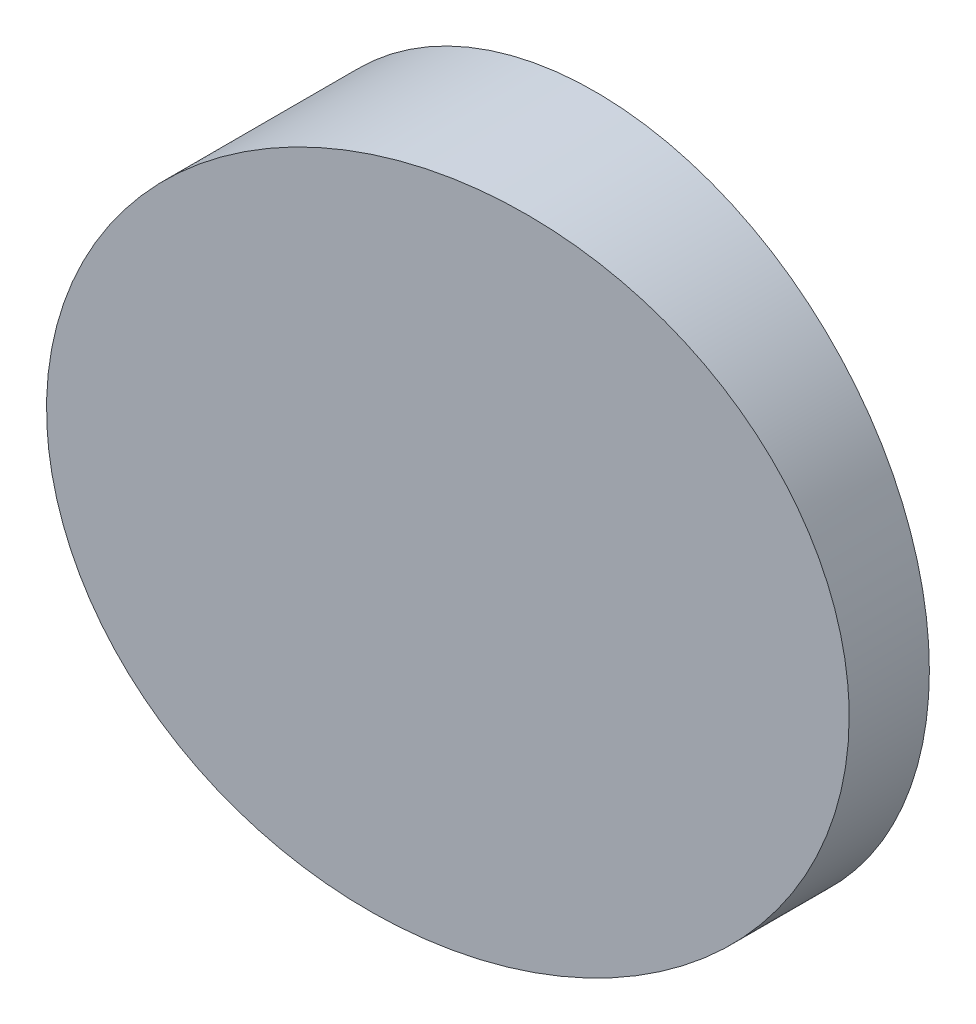
ISO-10303-21;
HEADER;
FILE_DESCRIPTION(('STEP AP214'),'2;1');
FILE_NAME('part.step','',(''),(''),'','','');
FILE_SCHEMA(('AUTOMOTIVE_DESIGN { 1 0 10303 214 1 1 1 1 }'));
ENDSEC;
DATA;
#1=APPLICATION_CONTEXT('core data for automotive mechanical design processes');
#2=APPLICATION_PROTOCOL_DEFINITION('international standard','automotive_design',2000,#1);
#3=PRODUCT_CONTEXT('',#1,'mechanical');
#4=PRODUCT('Part','Part','',(#3));
#5=PRODUCT_RELATED_PRODUCT_CATEGORY('part','',(#4));
#6=PRODUCT_DEFINITION_FORMATION('','',#4);
#7=PRODUCT_DEFINITION_CONTEXT('part definition',#1,'design');
#8=PRODUCT_DEFINITION('design','',#6,#7);
#9=PRODUCT_DEFINITION_SHAPE('','',#8);
#10=(LENGTH_UNIT() NAMED_UNIT(*) SI_UNIT(.MILLI.,.METRE.));
#11=(NAMED_UNIT(*) PLANE_ANGLE_UNIT() SI_UNIT($,.RADIAN.));
#12=(NAMED_UNIT(*) SI_UNIT($,.STERADIAN.) SOLID_ANGLE_UNIT());
#13=UNCERTAINTY_MEASURE_WITH_UNIT(LENGTH_MEASURE(1.E-05),#10,'distance_accuracy_value','');
#14=(GEOMETRIC_REPRESENTATION_CONTEXT(3) GLOBAL_UNCERTAINTY_ASSIGNED_CONTEXT((#13)) GLOBAL_UNIT_ASSIGNED_CONTEXT((#10,
#11,#12)) REPRESENTATION_CONTEXT('',''));
#15=CARTESIAN_POINT('',(0.,0.,0.));
#16=DIRECTION('',(0.,0.,1.));
#17=DIRECTION('',(1.,0.,0.));
#18=AXIS2_PLACEMENT_3D('',#15,#16,#17);
#19=CARTESIAN_POINT('',(0.,0.,10.));
#20=DIRECTION('',(0.,0.,-1.));
#21=DIRECTION('',(-1.,0.,0.));
#22=AXIS2_PLACEMENT_3D('',#19,#20,#21);
#23=CYLINDRICAL_SURFACE('',#22,12.5);
#24=CARTESIAN_POINT('',(0.,0.,5.50909230641996));
#25=DIRECTION('',(-0.196801817247395,0.,-0.980443289909275));
#26=DIRECTION('',(0.980443289909275,0.,-0.196801817247395));
#27=AXIS2_PLACEMENT_3D('',#24,#25,#26);
#28=ELLIPSE('',#27,12.7493350494108,12.5);
#29=CARTESIAN_POINT('',(12.5,0.,3.));
#30=VERTEX_POINT('',#29);
#31=EDGE_CURVE('E36',#30,#30,#28,.T.);
#32=ORIENTED_EDGE('',*,*,#31,.T.);
#33=EDGE_LOOP('',(#32));
#34=FACE_BOUND('',#33,.T.);
#35=CARTESIAN_POINT('',(0.,0.,0.));
#36=DIRECTION('',(0.,0.,1.));
#37=DIRECTION('',(1.,0.,0.));
#38=AXIS2_PLACEMENT_3D('',#35,#36,#37);
#39=CIRCLE('',#38,12.5);
#40=CARTESIAN_POINT('',(12.5,0.,0.));
#41=VERTEX_POINT('',#40);
#42=EDGE_CURVE('E10',#41,#41,#39,.T.);
#43=ORIENTED_EDGE('',*,*,#42,.T.);
#44=EDGE_LOOP('',(#43));
#45=FACE_BOUND('',#44,.T.);
#46=ADVANCED_FACE('F33',(#34,#45),#23,.T.);
#47=CARTESIAN_POINT('',(0.,0.,0.));
#48=DIRECTION('',(0.,0.,1.));
#49=DIRECTION('',(1.,0.,0.));
#50=AXIS2_PLACEMENT_3D('',#47,#48,#49);
#51=PLANE('',#50);
#52=ORIENTED_EDGE('',*,*,#42,.F.);
#53=EDGE_LOOP('',(#52));
#54=FACE_BOUND('',#53,.T.);
#55=ADVANCED_FACE('F48',(#54),#51,.F.);
#56=CARTESIAN_POINT('',(12.5,-25.,3.));
#57=DIRECTION('',(-0.196801817247395,0.,-0.980443289909275));
#58=DIRECTION('',(-0.980443289909275,0.,0.196801817247395));
#59=AXIS2_PLACEMENT_3D('',#56,#57,#58);
#60=PLANE('',#59);
#61=ORIENTED_EDGE('',*,*,#31,.F.);
#62=EDGE_LOOP('',(#61));
#63=FACE_BOUND('',#62,.T.);
#64=ADVANCED_FACE('F46',(#63),#60,.F.);
#65=CLOSED_SHELL('',(#46,#55,#64));
#66=MANIFOLD_SOLID_BREP('B2',#65);
#67=ADVANCED_BREP_SHAPE_REPRESENTATION('',(#18,#66),#14);
#68=SHAPE_DEFINITION_REPRESENTATION(#9,#67);
ENDSEC;
END-ISO-10303-21;
